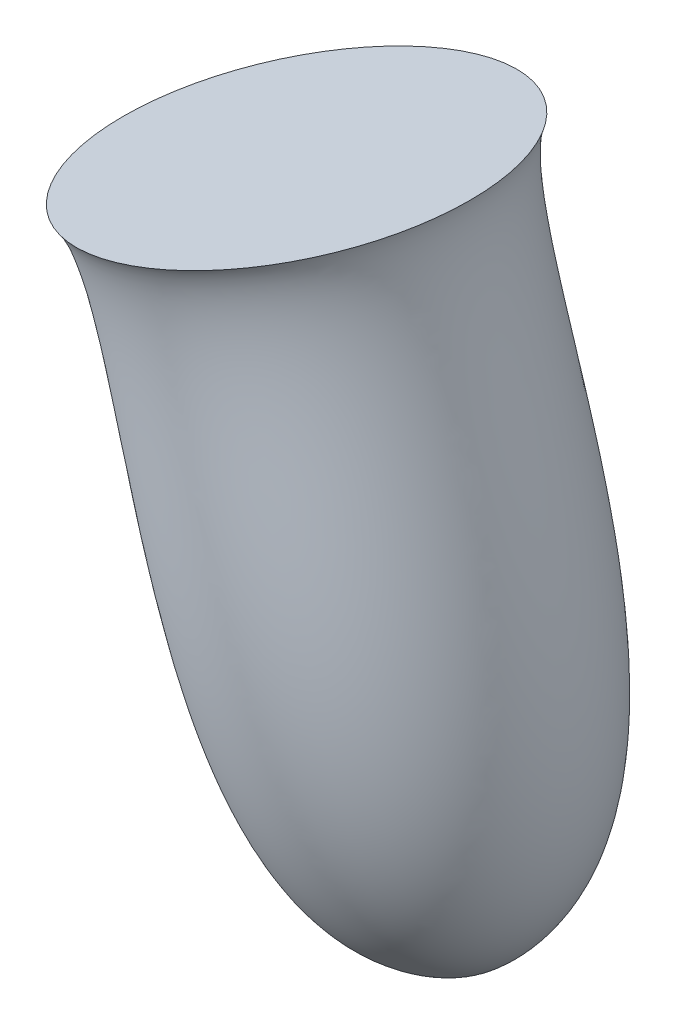
ISO-10303-21;
HEADER;
FILE_DESCRIPTION(('STEP AP214'),'2;1');
FILE_NAME('part.step','',(''),(''),'','','');
FILE_SCHEMA(('AUTOMOTIVE_DESIGN { 1 0 10303 214 1 1 1 1 }'));
ENDSEC;
DATA;
#1=APPLICATION_CONTEXT('core data for automotive mechanical design processes');
#2=APPLICATION_PROTOCOL_DEFINITION('international standard','automotive_design',2000,#1);
#3=PRODUCT_CONTEXT('',#1,'mechanical');
#4=PRODUCT('Part','Part','',(#3));
#5=PRODUCT_RELATED_PRODUCT_CATEGORY('part','',(#4));
#6=PRODUCT_DEFINITION_FORMATION('','',#4);
#7=PRODUCT_DEFINITION_CONTEXT('part definition',#1,'design');
#8=PRODUCT_DEFINITION('design','',#6,#7);
#9=PRODUCT_DEFINITION_SHAPE('','',#8);
#10=(LENGTH_UNIT() NAMED_UNIT(*) SI_UNIT(.MILLI.,.METRE.));
#11=(NAMED_UNIT(*) PLANE_ANGLE_UNIT() SI_UNIT($,.RADIAN.));
#12=(NAMED_UNIT(*) SI_UNIT($,.STERADIAN.) SOLID_ANGLE_UNIT());
#13=UNCERTAINTY_MEASURE_WITH_UNIT(LENGTH_MEASURE(1.E-05),#10,'distance_accuracy_value','');
#14=(GEOMETRIC_REPRESENTATION_CONTEXT(3) GLOBAL_UNCERTAINTY_ASSIGNED_CONTEXT((#13)) GLOBAL_UNIT_ASSIGNED_CONTEXT((#10,
#11,#12)) REPRESENTATION_CONTEXT('',''));
#15=CARTESIAN_POINT('',(0.,0.,0.));
#16=DIRECTION('',(0.,0.,1.));
#17=DIRECTION('',(1.,0.,0.));
#18=AXIS2_PLACEMENT_3D('',#15,#16,#17);
#19=CARTESIAN_POINT('',(-128.614241961207,34.4495513251848,0.));
#20=DIRECTION('',(-0.278551200610806,0.960421380769024,0.));
#21=DIRECTION('',(-0.960421380769024,-0.278551200610806,0.));
#22=AXIS2_PLACEMENT_3D('',#19,#20,#21);
#23=PLANE('',#22);
#24=CARTESIAN_POINT('',(-105.106178469312,41.2675995702781,0.));
#25=DIRECTION('',(-0.278551200610806,0.960421380769024,0.));
#26=DIRECTION('',(-0.960421380769024,-0.278551200610806,0.));
#27=AXIS2_PLACEMENT_3D('',#24,#25,#26);
#28=CIRCLE('',#27,24.4768223225847);
#29=CARTESIAN_POINT('',(-128.614241961207,34.4495513251848,0.));
#30=VERTEX_POINT('',#29);
#31=EDGE_CURVE('E11',#30,#30,#28,.T.);
#32=ORIENTED_EDGE('',*,*,#31,.T.);
#33=EDGE_LOOP('',(#32));
#34=FACE_BOUND('',#33,.T.);
#35=ADVANCED_FACE('F33',(#34),#23,.T.);
#36=CARTESIAN_POINT('',(-128.614241961207,34.4495513251848,0.));
#37=CARTESIAN_POINT('',(-118.024618976484,25.5032827579724,0.));
#38=CARTESIAN_POINT('',(-115.619677289487,-44.5570236606614,0.));
#39=CARTESIAN_POINT('',(-80.9495363576809,-42.0224940309061,0.));
#40=B_SPLINE_CURVE_WITH_KNOTS('',3,(#36,#37,#38,#39),.UNSPECIFIED.,.F.,.F.,(4,4),(0.,1.),.UNSPECIFIED.);
#41=CARTESIAN_POINT('',(-105.106178469312,41.2675995702782,0.));
#42=DIRECTION('',(-0.278551200610806,0.960421380769024,0.));
#43=AXIS1_PLACEMENT('',#41,#42);
#44=SURFACE_OF_REVOLUTION('',#40,#43);
#45=CARTESIAN_POINT('',(-80.9495363576809,-42.0224940309061,0.));
#46=VERTEX_POINT('',#45);
#47=VERTEX_LOOP('',#46);
#48=FACE_BOUND('',#47,.T.);
#49=ORIENTED_EDGE('',*,*,#31,.F.);
#50=EDGE_LOOP('',(#49));
#51=FACE_BOUND('',#50,.T.);
#52=ADVANCED_FACE('F41',(#48,#51),#44,.F.);
#53=CLOSED_SHELL('',(#35,#52));
#54=MANIFOLD_SOLID_BREP('B2',#53);
#55=ADVANCED_BREP_SHAPE_REPRESENTATION('',(#18,#54),#14);
#56=SHAPE_DEFINITION_REPRESENTATION(#9,#55);
ENDSEC;
END-ISO-10303-21;
